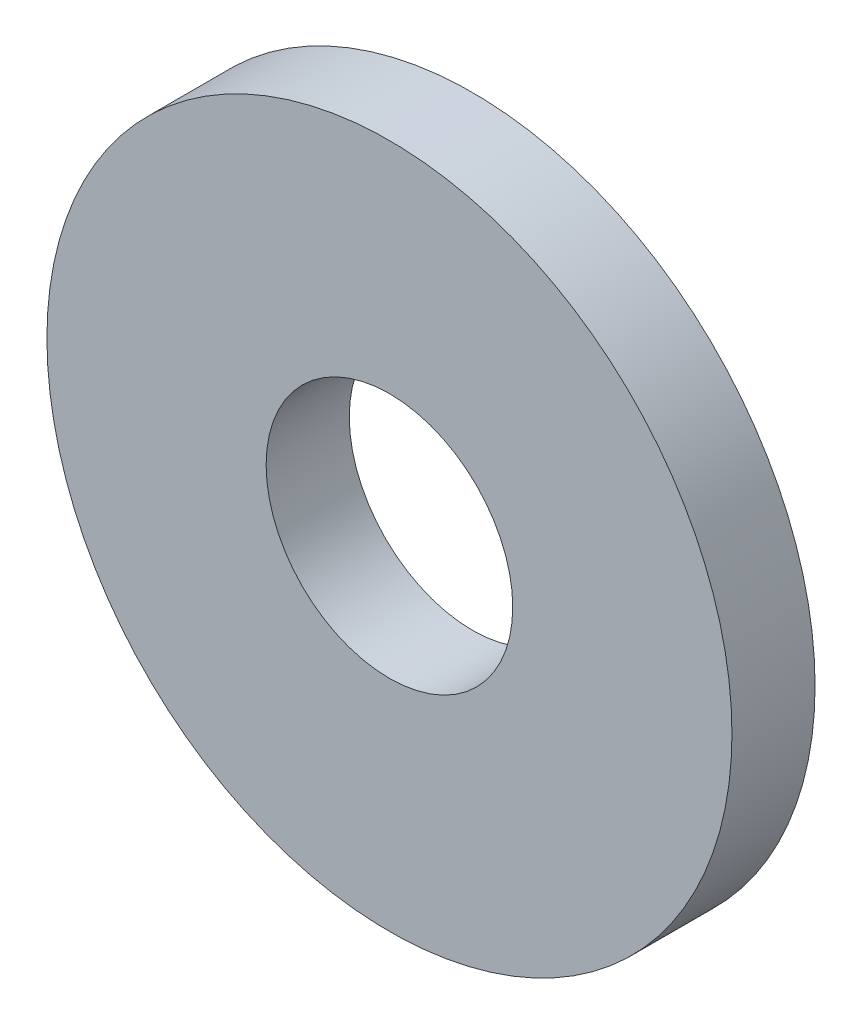
ISO-10303-21;
HEADER;
FILE_DESCRIPTION(('STEP AP214'),'2;1');
FILE_NAME('part.step','',(''),(''),'','','');
FILE_SCHEMA(('AUTOMOTIVE_DESIGN { 1 0 10303 214 1 1 1 1 }'));
ENDSEC;
DATA;
#1=APPLICATION_CONTEXT('core data for automotive mechanical design processes');
#2=APPLICATION_PROTOCOL_DEFINITION('international standard','automotive_design',2000,#1);
#3=PRODUCT_CONTEXT('',#1,'mechanical');
#4=PRODUCT('Part','Part','',(#3));
#5=PRODUCT_RELATED_PRODUCT_CATEGORY('part','',(#4));
#6=PRODUCT_DEFINITION_FORMATION('','',#4);
#7=PRODUCT_DEFINITION_CONTEXT('part definition',#1,'design');
#8=PRODUCT_DEFINITION('design','',#6,#7);
#9=PRODUCT_DEFINITION_SHAPE('','',#8);
#10=(LENGTH_UNIT() NAMED_UNIT(*) SI_UNIT(.MILLI.,.METRE.));
#11=(NAMED_UNIT(*) PLANE_ANGLE_UNIT() SI_UNIT($,.RADIAN.));
#12=(NAMED_UNIT(*) SI_UNIT($,.STERADIAN.) SOLID_ANGLE_UNIT());
#13=UNCERTAINTY_MEASURE_WITH_UNIT(LENGTH_MEASURE(1.E-05),#10,'distance_accuracy_value','');
#14=(GEOMETRIC_REPRESENTATION_CONTEXT(3) GLOBAL_UNCERTAINTY_ASSIGNED_CONTEXT((#13)) GLOBAL_UNIT_ASSIGNED_CONTEXT((#10,
#11,#12)) REPRESENTATION_CONTEXT('',''));
#15=CARTESIAN_POINT('',(0.,0.,0.));
#16=DIRECTION('',(0.,0.,1.));
#17=DIRECTION('',(1.,0.,0.));
#18=AXIS2_PLACEMENT_3D('',#15,#16,#17);
#19=CARTESIAN_POINT('',(0.,0.,2.3114));
#20=DIRECTION('',(0.,0.,1.));
#21=DIRECTION('',(1.,0.,0.));
#22=AXIS2_PLACEMENT_3D('',#19,#20,#21);
#23=PLANE('',#22);
#24=CARTESIAN_POINT('',(0.,0.,2.3114));
#25=DIRECTION('',(0.,0.,1.));
#26=DIRECTION('',(1.,0.,0.));
#27=AXIS2_PLACEMENT_3D('',#24,#25,#26);
#28=CIRCLE('',#27,9.525);
#29=CARTESIAN_POINT('',(9.525,0.,2.3114));
#30=VERTEX_POINT('',#29);
#31=EDGE_CURVE('E10',#30,#30,#28,.T.);
#32=ORIENTED_EDGE('',*,*,#31,.T.);
#33=EDGE_LOOP('',(#32));
#34=FACE_BOUND('',#33,.T.);
#35=CARTESIAN_POINT('',(0.,0.,2.3114));
#36=DIRECTION('',(0.,0.,1.));
#37=DIRECTION('',(1.,0.,0.));
#38=AXIS2_PLACEMENT_3D('',#35,#36,#37);
#39=CIRCLE('',#38,3.429);
#40=CARTESIAN_POINT('',(3.429,0.,2.3114));
#41=VERTEX_POINT('',#40);
#42=EDGE_CURVE('E42',#41,#41,#39,.T.);
#43=ORIENTED_EDGE('',*,*,#42,.F.);
#44=EDGE_LOOP('',(#43));
#45=FACE_BOUND('',#44,.T.);
#46=ADVANCED_FACE('F31',(#34,#45),#23,.T.);
#47=CARTESIAN_POINT('',(0.,0.,0.));
#48=DIRECTION('',(0.,0.,1.));
#49=DIRECTION('',(1.,0.,0.));
#50=AXIS2_PLACEMENT_3D('',#47,#48,#49);
#51=PLANE('',#50);
#52=CARTESIAN_POINT('',(0.,0.,0.));
#53=DIRECTION('',(0.,0.,1.));
#54=DIRECTION('',(1.,0.,0.));
#55=AXIS2_PLACEMENT_3D('',#52,#53,#54);
#56=CIRCLE('',#55,9.525);
#57=CARTESIAN_POINT('',(9.525,0.,0.));
#58=VERTEX_POINT('',#57);
#59=EDGE_CURVE('E35',#58,#58,#56,.T.);
#60=ORIENTED_EDGE('',*,*,#59,.F.);
#61=EDGE_LOOP('',(#60));
#62=FACE_BOUND('',#61,.T.);
#63=CARTESIAN_POINT('',(0.,0.,0.));
#64=DIRECTION('',(0.,0.,1.));
#65=DIRECTION('',(1.,0.,0.));
#66=AXIS2_PLACEMENT_3D('',#63,#64,#65);
#67=CIRCLE('',#66,3.429);
#68=CARTESIAN_POINT('',(3.429,0.,0.));
#69=VERTEX_POINT('',#68);
#70=EDGE_CURVE('E44',#69,#69,#67,.T.);
#71=ORIENTED_EDGE('',*,*,#70,.T.);
#72=EDGE_LOOP('',(#71));
#73=FACE_BOUND('',#72,.T.);
#74=ADVANCED_FACE('F54',(#62,#73),#51,.F.);
#75=CARTESIAN_POINT('',(0.,0.,2.3114));
#76=DIRECTION('',(0.,0.,-1.));
#77=DIRECTION('',(-1.,0.,0.));
#78=AXIS2_PLACEMENT_3D('',#75,#76,#77);
#79=CYLINDRICAL_SURFACE('',#78,9.525);
#80=ORIENTED_EDGE('',*,*,#31,.F.);
#81=EDGE_LOOP('',(#80));
#82=FACE_BOUND('',#81,.T.);
#83=ORIENTED_EDGE('',*,*,#59,.T.);
#84=EDGE_LOOP('',(#83));
#85=FACE_BOUND('',#84,.T.);
#86=ADVANCED_FACE('F33',(#82,#85),#79,.T.);
#87=CARTESIAN_POINT('',(0.,0.,2.3114));
#88=DIRECTION('',(0.,0.,-1.));
#89=DIRECTION('',(-1.,0.,0.));
#90=AXIS2_PLACEMENT_3D('',#87,#88,#89);
#91=CYLINDRICAL_SURFACE('',#90,3.429);
#92=ORIENTED_EDGE('',*,*,#42,.T.);
#93=EDGE_LOOP('',(#92));
#94=FACE_BOUND('',#93,.T.);
#95=ORIENTED_EDGE('',*,*,#70,.F.);
#96=EDGE_LOOP('',(#95));
#97=FACE_BOUND('',#96,.T.);
#98=ADVANCED_FACE('F50',(#94,#97),#91,.F.);
#99=CLOSED_SHELL('',(#46,#74,#86,#98));
#100=MANIFOLD_SOLID_BREP('B2',#99);
#101=ADVANCED_BREP_SHAPE_REPRESENTATION('',(#18,#100),#14);
#102=SHAPE_DEFINITION_REPRESENTATION(#9,#101);
ENDSEC;
END-ISO-10303-21;
